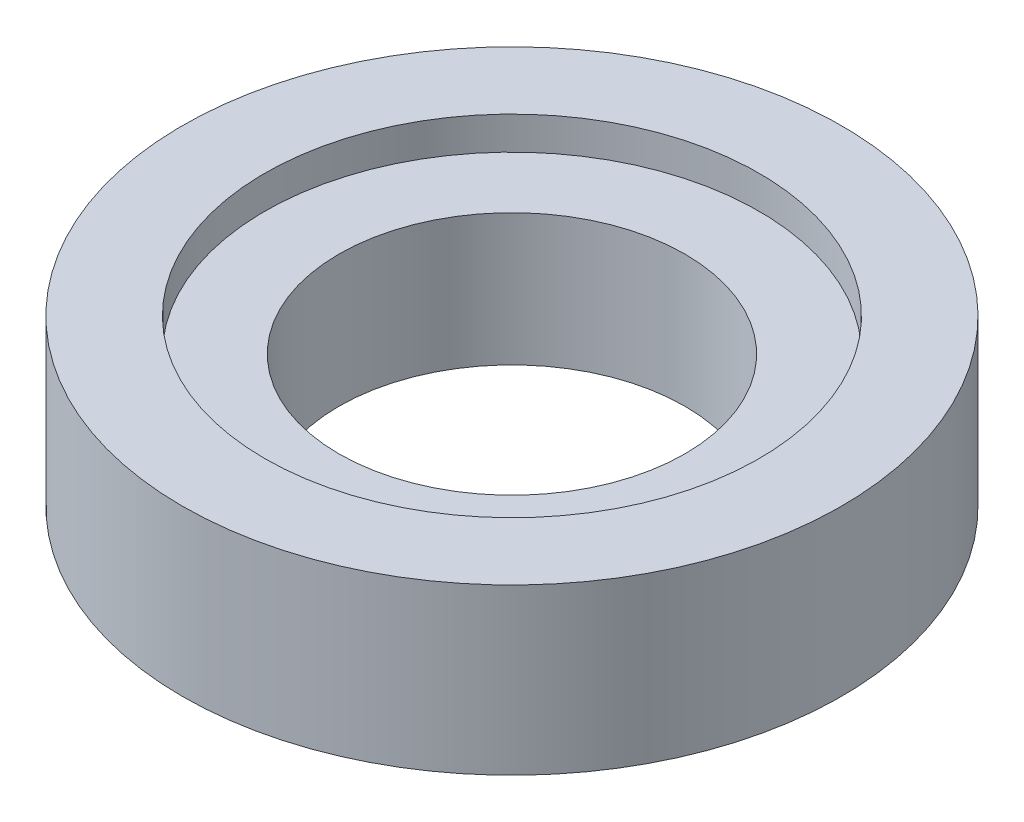
ISO-10303-21;
HEADER;
FILE_DESCRIPTION(('STEP AP214'),'2;1');
FILE_NAME('part.step','',(''),(''),'','','');
FILE_SCHEMA(('AUTOMOTIVE_DESIGN { 1 0 10303 214 1 1 1 1 }'));
ENDSEC;
DATA;
#1=APPLICATION_CONTEXT('core data for automotive mechanical design processes');
#2=APPLICATION_PROTOCOL_DEFINITION('international standard','automotive_design',2000,#1);
#3=PRODUCT_CONTEXT('',#1,'mechanical');
#4=PRODUCT('Part','Part','',(#3));
#5=PRODUCT_RELATED_PRODUCT_CATEGORY('part','',(#4));
#6=PRODUCT_DEFINITION_FORMATION('','',#4);
#7=PRODUCT_DEFINITION_CONTEXT('part definition',#1,'design');
#8=PRODUCT_DEFINITION('design','',#6,#7);
#9=PRODUCT_DEFINITION_SHAPE('','',#8);
#10=(LENGTH_UNIT() NAMED_UNIT(*) SI_UNIT(.MILLI.,.METRE.));
#11=(NAMED_UNIT(*) PLANE_ANGLE_UNIT() SI_UNIT($,.RADIAN.));
#12=(NAMED_UNIT(*) SI_UNIT($,.STERADIAN.) SOLID_ANGLE_UNIT());
#13=UNCERTAINTY_MEASURE_WITH_UNIT(LENGTH_MEASURE(1.E-05),#10,'distance_accuracy_value','');
#14=(GEOMETRIC_REPRESENTATION_CONTEXT(3) GLOBAL_UNCERTAINTY_ASSIGNED_CONTEXT((#13)) GLOBAL_UNIT_ASSIGNED_CONTEXT((#10,
#11,#12)) REPRESENTATION_CONTEXT('',''));
#15=CARTESIAN_POINT('',(0.,0.,0.));
#16=DIRECTION('',(0.,0.,1.));
#17=DIRECTION('',(1.,0.,0.));
#18=AXIS2_PLACEMENT_3D('',#15,#16,#17);
#19=CARTESIAN_POINT('',(0.,5.,0.));
#20=DIRECTION('',(0.,-1.,0.));
#21=DIRECTION('',(0.,0.,-1.));
#22=AXIS2_PLACEMENT_3D('',#19,#20,#21);
#23=CYLINDRICAL_SURFACE('',#22,5.25);
#24=CARTESIAN_POINT('',(0.,0.,0.));
#25=DIRECTION('',(0.,1.,0.));
#26=DIRECTION('',(0.,0.,1.));
#27=AXIS2_PLACEMENT_3D('',#24,#25,#26);
#28=CIRCLE('',#27,5.25);
#29=CARTESIAN_POINT('',(0.,0.,5.25));
#30=VERTEX_POINT('',#29);
#31=EDGE_CURVE('E42',#30,#30,#28,.T.);
#32=ORIENTED_EDGE('',*,*,#31,.F.);
#33=EDGE_LOOP('',(#32));
#34=FACE_BOUND('',#33,.T.);
#35=CARTESIAN_POINT('',(0.,4.,0.));
#36=DIRECTION('',(0.,1.,0.));
#37=DIRECTION('',(0.,0.,1.));
#38=AXIS2_PLACEMENT_3D('',#35,#36,#37);
#39=CIRCLE('',#38,5.25);
#40=CARTESIAN_POINT('',(0.,4.,5.25));
#41=VERTEX_POINT('',#40);
#42=EDGE_CURVE('E33',#41,#41,#39,.T.);
#43=ORIENTED_EDGE('',*,*,#42,.T.);
#44=EDGE_LOOP('',(#43));
#45=FACE_BOUND('',#44,.T.);
#46=ADVANCED_FACE('F29',(#34,#45),#23,.F.);
#47=CARTESIAN_POINT('',(0.,5.,0.));
#48=DIRECTION('',(0.,1.,0.));
#49=DIRECTION('',(0.,0.,1.));
#50=AXIS2_PLACEMENT_3D('',#47,#48,#49);
#51=PLANE('',#50);
#52=CARTESIAN_POINT('',(0.,5.,0.));
#53=DIRECTION('',(0.,1.,0.));
#54=DIRECTION('',(0.,0.,1.));
#55=AXIS2_PLACEMENT_3D('',#52,#53,#54);
#56=CIRCLE('',#55,7.5);
#57=CARTESIAN_POINT('',(0.,5.,7.5));
#58=VERTEX_POINT('',#57);
#59=EDGE_CURVE('E46',#58,#58,#56,.T.);
#60=ORIENTED_EDGE('',*,*,#59,.F.);
#61=EDGE_LOOP('',(#60));
#62=FACE_BOUND('',#61,.T.);
#63=CARTESIAN_POINT('',(0.,5.,0.));
#64=DIRECTION('',(0.,1.,0.));
#65=DIRECTION('',(0.,0.,1.));
#66=AXIS2_PLACEMENT_3D('',#63,#64,#65);
#67=CIRCLE('',#66,10.);
#68=CARTESIAN_POINT('',(0.,5.,10.));
#69=VERTEX_POINT('',#68);
#70=EDGE_CURVE('E10',#69,#69,#67,.T.);
#71=ORIENTED_EDGE('',*,*,#70,.T.);
#72=EDGE_LOOP('',(#71));
#73=FACE_BOUND('',#72,.T.);
#74=ADVANCED_FACE('F67',(#62,#73),#51,.T.);
#75=CARTESIAN_POINT('',(0.,0.,0.));
#76=DIRECTION('',(0.,1.,0.));
#77=DIRECTION('',(0.,0.,1.));
#78=AXIS2_PLACEMENT_3D('',#75,#76,#77);
#79=PLANE('',#78);
#80=CARTESIAN_POINT('',(0.,0.,0.));
#81=DIRECTION('',(0.,1.,0.));
#82=DIRECTION('',(0.,0.,1.));
#83=AXIS2_PLACEMENT_3D('',#80,#81,#82);
#84=CIRCLE('',#83,10.);
#85=CARTESIAN_POINT('',(0.,0.,10.));
#86=VERTEX_POINT('',#85);
#87=EDGE_CURVE('E37',#86,#86,#84,.T.);
#88=ORIENTED_EDGE('',*,*,#87,.F.);
#89=EDGE_LOOP('',(#88));
#90=FACE_BOUND('',#89,.T.);
#91=ORIENTED_EDGE('',*,*,#31,.T.);
#92=EDGE_LOOP('',(#91));
#93=FACE_BOUND('',#92,.T.);
#94=ADVANCED_FACE('F73',(#90,#93),#79,.F.);
#95=CARTESIAN_POINT('',(0.,5.,0.));
#96=DIRECTION('',(0.,-1.,0.));
#97=DIRECTION('',(0.,0.,-1.));
#98=AXIS2_PLACEMENT_3D('',#95,#96,#97);
#99=CYLINDRICAL_SURFACE('',#98,10.);
#100=ORIENTED_EDGE('',*,*,#70,.F.);
#101=EDGE_LOOP('',(#100));
#102=FACE_BOUND('',#101,.T.);
#103=ORIENTED_EDGE('',*,*,#87,.T.);
#104=EDGE_LOOP('',(#103));
#105=FACE_BOUND('',#104,.T.);
#106=ADVANCED_FACE('F31',(#102,#105),#99,.T.);
#107=CARTESIAN_POINT('',(0.,4.,0.));
#108=DIRECTION('',(0.,1.,0.));
#109=DIRECTION('',(0.,0.,1.));
#110=AXIS2_PLACEMENT_3D('',#107,#108,#109);
#111=CYLINDRICAL_SURFACE('',#110,7.5);
#112=CARTESIAN_POINT('',(0.,4.,0.));
#113=DIRECTION('',(0.,1.,0.));
#114=DIRECTION('',(0.,0.,1.));
#115=AXIS2_PLACEMENT_3D('',#112,#113,#114);
#116=CIRCLE('',#115,7.5);
#117=CARTESIAN_POINT('',(0.,4.,7.5));
#118=VERTEX_POINT('',#117);
#119=EDGE_CURVE('E49',#118,#118,#116,.T.);
#120=ORIENTED_EDGE('',*,*,#119,.F.);
#121=EDGE_LOOP('',(#120));
#122=FACE_BOUND('',#121,.T.);
#123=ORIENTED_EDGE('',*,*,#59,.T.);
#124=EDGE_LOOP('',(#123));
#125=FACE_BOUND('',#124,.T.);
#126=ADVANCED_FACE('F59',(#122,#125),#111,.F.);
#127=CARTESIAN_POINT('',(0.,4.,0.));
#128=DIRECTION('',(0.,1.,0.));
#129=DIRECTION('',(0.,0.,1.));
#130=AXIS2_PLACEMENT_3D('',#127,#128,#129);
#131=PLANE('',#130);
#132=ORIENTED_EDGE('',*,*,#42,.F.);
#133=EDGE_LOOP('',(#132));
#134=FACE_BOUND('',#133,.T.);
#135=ORIENTED_EDGE('',*,*,#119,.T.);
#136=EDGE_LOOP('',(#135));
#137=FACE_BOUND('',#136,.T.);
#138=ADVANCED_FACE('F57',(#134,#137),#131,.T.);
#139=CLOSED_SHELL('',(#46,#74,#94,#106,#126,#138));
#140=MANIFOLD_SOLID_BREP('B2',#139);
#141=ADVANCED_BREP_SHAPE_REPRESENTATION('',(#18,#140),#14);
#142=SHAPE_DEFINITION_REPRESENTATION(#9,#141);
ENDSEC;
END-ISO-10303-21;
